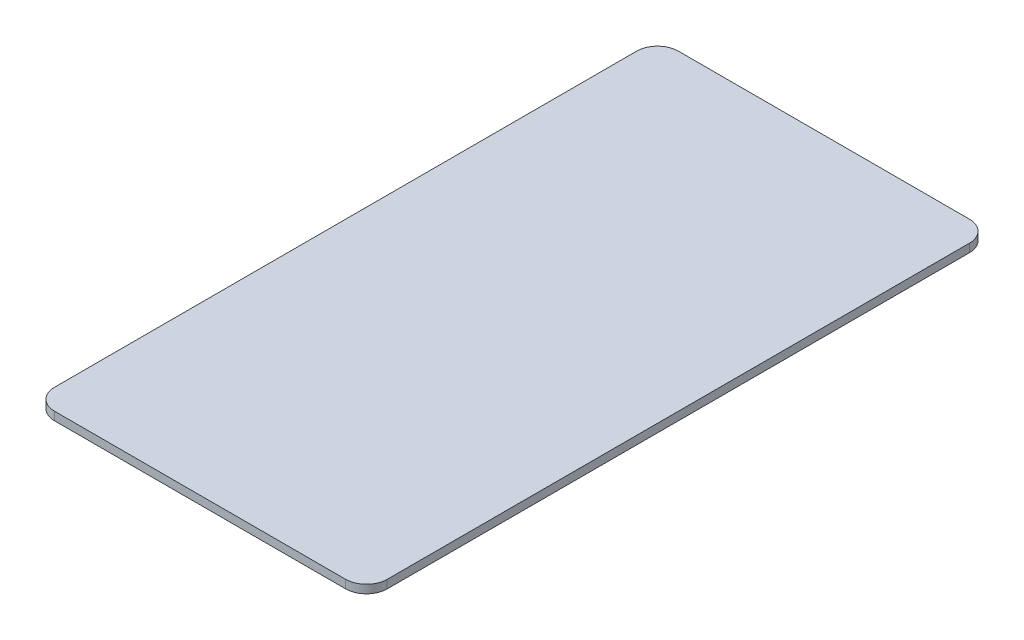
ISO-10303-21;
HEADER;
FILE_DESCRIPTION(('STEP AP214'),'2;1');
FILE_NAME('part.step','',(''),(''),'','','');
FILE_SCHEMA(('AUTOMOTIVE_DESIGN { 1 0 10303 214 1 1 1 1 }'));
ENDSEC;
DATA;
#1=APPLICATION_CONTEXT('core data for automotive mechanical design processes');
#2=APPLICATION_PROTOCOL_DEFINITION('international standard','automotive_design',2000,#1);
#3=PRODUCT_CONTEXT('',#1,'mechanical');
#4=PRODUCT('Part','Part','',(#3));
#5=PRODUCT_RELATED_PRODUCT_CATEGORY('part','',(#4));
#6=PRODUCT_DEFINITION_FORMATION('','',#4);
#7=PRODUCT_DEFINITION_CONTEXT('part definition',#1,'design');
#8=PRODUCT_DEFINITION('design','',#6,#7);
#9=PRODUCT_DEFINITION_SHAPE('','',#8);
#10=(LENGTH_UNIT() NAMED_UNIT(*) SI_UNIT(.MILLI.,.METRE.));
#11=(NAMED_UNIT(*) PLANE_ANGLE_UNIT() SI_UNIT($,.RADIAN.));
#12=(NAMED_UNIT(*) SI_UNIT($,.STERADIAN.) SOLID_ANGLE_UNIT());
#13=UNCERTAINTY_MEASURE_WITH_UNIT(LENGTH_MEASURE(1.E-05),#10,'distance_accuracy_value','');
#14=(GEOMETRIC_REPRESENTATION_CONTEXT(3) GLOBAL_UNCERTAINTY_ASSIGNED_CONTEXT((#13)) GLOBAL_UNIT_ASSIGNED_CONTEXT((#10,
#11,#12)) REPRESENTATION_CONTEXT('',''));
#15=CARTESIAN_POINT('',(0.,0.,0.));
#16=DIRECTION('',(0.,0.,1.));
#17=DIRECTION('',(1.,0.,0.));
#18=AXIS2_PLACEMENT_3D('',#15,#16,#17);
#19=CARTESIAN_POINT('',(0.,1.27,0.));
#20=DIRECTION('',(1.,0.,0.));
#21=DIRECTION('',(0.,0.,-1.));
#22=AXIS2_PLACEMENT_3D('',#19,#20,#21);
#23=PLANE('',#22);
#24=DIRECTION('',(0.,0.,1.));
#25=VECTOR('',#24,1.);
#26=CARTESIAN_POINT('',(0.,1.27,0.));
#27=LINE('',#26,#25);
#28=CARTESIAN_POINT('',(0.,1.27,-92.075));
#29=VERTEX_POINT('',#28);
#30=CARTESIAN_POINT('',(0.,1.27,-3.175));
#31=VERTEX_POINT('',#30);
#32=EDGE_CURVE('E121',#29,#31,#27,.T.);
#33=ORIENTED_EDGE('',*,*,#32,.F.);
#34=DIRECTION('',(0.,-1.,0.));
#35=VECTOR('',#34,1.);
#36=CARTESIAN_POINT('',(0.,1.27,-92.075));
#37=LINE('',#36,#35);
#38=CARTESIAN_POINT('',(0.,0.,-92.075));
#39=VERTEX_POINT('',#38);
#40=EDGE_CURVE('E106',#29,#39,#37,.T.);
#41=ORIENTED_EDGE('',*,*,#40,.T.);
#42=DIRECTION('',(0.,0.,1.));
#43=VECTOR('',#42,1.);
#44=CARTESIAN_POINT('',(0.,0.,0.));
#45=LINE('',#44,#43);
#46=CARTESIAN_POINT('',(0.,0.,-3.175));
#47=VERTEX_POINT('',#46);
#48=EDGE_CURVE('E118',#39,#47,#45,.T.);
#49=ORIENTED_EDGE('',*,*,#48,.T.);
#50=DIRECTION('',(0.,-1.,0.));
#51=VECTOR('',#50,1.);
#52=CARTESIAN_POINT('',(0.,1.27,-3.175));
#53=LINE('',#52,#51);
#54=EDGE_CURVE('E123',#47,#31,#53,.F.);
#55=ORIENTED_EDGE('',*,*,#54,.T.);
#56=EDGE_LOOP('',(#33,#41,#49,#55));
#57=FACE_BOUND('',#56,.T.);
#58=ADVANCED_FACE('F36',(#57),#23,.F.);
#59=CARTESIAN_POINT('',(0.,1.27,0.));
#60=DIRECTION('',(0.,0.,-1.));
#61=DIRECTION('',(-1.,0.,0.));
#62=AXIS2_PLACEMENT_3D('',#59,#60,#61);
#63=PLANE('',#62);
#64=DIRECTION('',(1.,0.,0.));
#65=VECTOR('',#64,1.);
#66=CARTESIAN_POINT('',(0.,0.,0.));
#67=LINE('',#66,#65);
#68=CARTESIAN_POINT('',(3.175,0.,0.));
#69=VERTEX_POINT('',#68);
#70=CARTESIAN_POINT('',(47.625,0.,0.));
#71=VERTEX_POINT('',#70);
#72=EDGE_CURVE('E127',#69,#71,#67,.T.);
#73=ORIENTED_EDGE('',*,*,#72,.T.);
#74=DIRECTION('',(0.,-1.,0.));
#75=VECTOR('',#74,1.);
#76=CARTESIAN_POINT('',(47.625,1.27,0.));
#77=LINE('',#76,#75);
#78=CARTESIAN_POINT('',(47.625,1.27,0.));
#79=VERTEX_POINT('',#78);
#80=EDGE_CURVE('E11',#71,#79,#77,.F.);
#81=ORIENTED_EDGE('',*,*,#80,.T.);
#82=DIRECTION('',(1.,0.,0.));
#83=VECTOR('',#82,1.);
#84=CARTESIAN_POINT('',(0.,1.27,0.));
#85=LINE('',#84,#83);
#86=CARTESIAN_POINT('',(3.175,1.27,0.));
#87=VERTEX_POINT('',#86);
#88=EDGE_CURVE('E163',#87,#79,#85,.T.);
#89=ORIENTED_EDGE('',*,*,#88,.F.);
#90=DIRECTION('',(0.,-1.,0.));
#91=VECTOR('',#90,1.);
#92=CARTESIAN_POINT('',(3.175,1.27,0.));
#93=LINE('',#92,#91);
#94=EDGE_CURVE('E44',#87,#69,#93,.T.);
#95=ORIENTED_EDGE('',*,*,#94,.T.);
#96=EDGE_LOOP('',(#73,#81,#89,#95));
#97=FACE_BOUND('',#96,.T.);
#98=ADVANCED_FACE('F161',(#97),#63,.F.);
#99=CARTESIAN_POINT('',(50.8,1.27,0.));
#100=DIRECTION('',(-1.,0.,0.));
#101=DIRECTION('',(0.,0.,1.));
#102=AXIS2_PLACEMENT_3D('',#99,#100,#101);
#103=PLANE('',#102);
#104=DIRECTION('',(0.,0.,-1.));
#105=VECTOR('',#104,1.);
#106=CARTESIAN_POINT('',(50.8,0.,0.));
#107=LINE('',#106,#105);
#108=CARTESIAN_POINT('',(50.8,0.,-3.175));
#109=VERTEX_POINT('',#108);
#110=CARTESIAN_POINT('',(50.8,0.,-92.075));
#111=VERTEX_POINT('',#110);
#112=EDGE_CURVE('E130',#109,#111,#107,.T.);
#113=ORIENTED_EDGE('',*,*,#112,.T.);
#114=DIRECTION('',(0.,-1.,0.));
#115=VECTOR('',#114,1.);
#116=CARTESIAN_POINT('',(50.8,1.27,-92.075));
#117=LINE('',#116,#115);
#118=CARTESIAN_POINT('',(50.8,1.27,-92.075));
#119=VERTEX_POINT('',#118);
#120=EDGE_CURVE('E51',#111,#119,#117,.F.);
#121=ORIENTED_EDGE('',*,*,#120,.T.);
#122=DIRECTION('',(0.,0.,-1.));
#123=VECTOR('',#122,1.);
#124=CARTESIAN_POINT('',(50.8,1.27,0.));
#125=LINE('',#124,#123);
#126=CARTESIAN_POINT('',(50.8,1.27,-3.175));
#127=VERTEX_POINT('',#126);
#128=EDGE_CURVE('E171',#127,#119,#125,.T.);
#129=ORIENTED_EDGE('',*,*,#128,.F.);
#130=DIRECTION('',(0.,-1.,0.));
#131=VECTOR('',#130,1.);
#132=CARTESIAN_POINT('',(50.8,1.27,-3.175));
#133=LINE('',#132,#131);
#134=EDGE_CURVE('E154',#127,#109,#133,.T.);
#135=ORIENTED_EDGE('',*,*,#134,.T.);
#136=EDGE_LOOP('',(#113,#121,#129,#135));
#137=FACE_BOUND('',#136,.T.);
#138=ADVANCED_FACE('F170',(#137),#103,.F.);
#139=CARTESIAN_POINT('',(0.,1.27,-95.25));
#140=DIRECTION('',(0.,0.,1.));
#141=DIRECTION('',(1.,0.,0.));
#142=AXIS2_PLACEMENT_3D('',#139,#140,#141);
#143=PLANE('',#142);
#144=DIRECTION('',(-1.,0.,0.));
#145=VECTOR('',#144,1.);
#146=CARTESIAN_POINT('',(0.,0.,-95.25));
#147=LINE('',#146,#145);
#148=CARTESIAN_POINT('',(47.625,0.,-95.25));
#149=VERTEX_POINT('',#148);
#150=CARTESIAN_POINT('',(3.175,0.,-95.25));
#151=VERTEX_POINT('',#150);
#152=EDGE_CURVE('E137',#149,#151,#147,.T.);
#153=ORIENTED_EDGE('',*,*,#152,.T.);
#154=DIRECTION('',(0.,-1.,0.));
#155=VECTOR('',#154,1.);
#156=CARTESIAN_POINT('',(3.175,1.27,-95.25));
#157=LINE('',#156,#155);
#158=CARTESIAN_POINT('',(3.175,1.27,-95.25));
#159=VERTEX_POINT('',#158);
#160=EDGE_CURVE('E107',#151,#159,#157,.F.);
#161=ORIENTED_EDGE('',*,*,#160,.T.);
#162=DIRECTION('',(-1.,0.,0.));
#163=VECTOR('',#162,1.);
#164=CARTESIAN_POINT('',(0.,1.27,-95.25));
#165=LINE('',#164,#163);
#166=CARTESIAN_POINT('',(47.625,1.27,-95.25));
#167=VERTEX_POINT('',#166);
#168=EDGE_CURVE('E133',#167,#159,#165,.T.);
#169=ORIENTED_EDGE('',*,*,#168,.F.);
#170=DIRECTION('',(0.,-1.,0.));
#171=VECTOR('',#170,1.);
#172=CARTESIAN_POINT('',(47.625,1.27,-95.25));
#173=LINE('',#172,#171);
#174=EDGE_CURVE('E112',#167,#149,#173,.T.);
#175=ORIENTED_EDGE('',*,*,#174,.T.);
#176=EDGE_LOOP('',(#153,#161,#169,#175));
#177=FACE_BOUND('',#176,.T.);
#178=ADVANCED_FACE('F199',(#177),#143,.F.);
#179=CARTESIAN_POINT('',(0.,1.27,0.));
#180=DIRECTION('',(0.,-1.,0.));
#181=DIRECTION('',(0.,0.,-1.));
#182=AXIS2_PLACEMENT_3D('',#179,#180,#181);
#183=PLANE('',#182);
#184=ORIENTED_EDGE('',*,*,#168,.T.);
#185=CARTESIAN_POINT('',(3.175,1.27,-92.075));
#186=DIRECTION('',(0.,-1.,0.));
#187=DIRECTION('',(0.,0.,-1.));
#188=AXIS2_PLACEMENT_3D('',#185,#186,#187);
#189=CIRCLE('',#188,3.175);
#190=EDGE_CURVE('E152',#159,#29,#189,.F.);
#191=ORIENTED_EDGE('',*,*,#190,.T.);
#192=ORIENTED_EDGE('',*,*,#32,.T.);
#193=CARTESIAN_POINT('',(3.175,1.27,-3.175));
#194=DIRECTION('',(0.,-1.,0.));
#195=DIRECTION('',(0.,0.,-1.));
#196=AXIS2_PLACEMENT_3D('',#193,#194,#195);
#197=CIRCLE('',#196,3.175);
#198=EDGE_CURVE('E147',#31,#87,#197,.F.);
#199=ORIENTED_EDGE('',*,*,#198,.T.);
#200=ORIENTED_EDGE('',*,*,#88,.T.);
#201=CARTESIAN_POINT('',(47.625,1.27,-3.175));
#202=DIRECTION('',(0.,-1.,0.));
#203=DIRECTION('',(0.,0.,-1.));
#204=AXIS2_PLACEMENT_3D('',#201,#202,#203);
#205=CIRCLE('',#204,3.175);
#206=EDGE_CURVE('E58',#79,#127,#205,.F.);
#207=ORIENTED_EDGE('',*,*,#206,.T.);
#208=ORIENTED_EDGE('',*,*,#128,.T.);
#209=CARTESIAN_POINT('',(47.625,1.27,-92.075));
#210=DIRECTION('',(0.,-1.,0.));
#211=DIRECTION('',(0.,0.,-1.));
#212=AXIS2_PLACEMENT_3D('',#209,#210,#211);
#213=CIRCLE('',#212,3.175);
#214=EDGE_CURVE('E150',#119,#167,#213,.F.);
#215=ORIENTED_EDGE('',*,*,#214,.T.);
#216=EDGE_LOOP('',(#184,#191,#192,#199,#200,#207,#208,#215));
#217=FACE_BOUND('',#216,.T.);
#218=ADVANCED_FACE('F176',(#217),#183,.F.);
#219=CARTESIAN_POINT('',(0.,0.,0.));
#220=DIRECTION('',(0.,-1.,0.));
#221=DIRECTION('',(0.,0.,-1.));
#222=AXIS2_PLACEMENT_3D('',#219,#220,#221);
#223=PLANE('',#222);
#224=ORIENTED_EDGE('',*,*,#48,.F.);
#225=CARTESIAN_POINT('',(3.175,0.,-92.075));
#226=DIRECTION('',(0.,-1.,0.));
#227=DIRECTION('',(0.,0.,-1.));
#228=AXIS2_PLACEMENT_3D('',#225,#226,#227);
#229=CIRCLE('',#228,3.175);
#230=EDGE_CURVE('E102',#39,#151,#229,.T.);
#231=ORIENTED_EDGE('',*,*,#230,.T.);
#232=ORIENTED_EDGE('',*,*,#152,.F.);
#233=CARTESIAN_POINT('',(47.625,0.,-92.075));
#234=DIRECTION('',(0.,-1.,0.));
#235=DIRECTION('',(0.,0.,-1.));
#236=AXIS2_PLACEMENT_3D('',#233,#234,#235);
#237=CIRCLE('',#236,3.175);
#238=EDGE_CURVE('E113',#149,#111,#237,.T.);
#239=ORIENTED_EDGE('',*,*,#238,.T.);
#240=ORIENTED_EDGE('',*,*,#112,.F.);
#241=CARTESIAN_POINT('',(47.625,0.,-3.175));
#242=DIRECTION('',(0.,-1.,0.));
#243=DIRECTION('',(0.,0.,-1.));
#244=AXIS2_PLACEMENT_3D('',#241,#242,#243);
#245=CIRCLE('',#244,3.175);
#246=EDGE_CURVE('E141',#109,#71,#245,.T.);
#247=ORIENTED_EDGE('',*,*,#246,.T.);
#248=ORIENTED_EDGE('',*,*,#72,.F.);
#249=CARTESIAN_POINT('',(3.175,0.,-3.175));
#250=DIRECTION('',(0.,-1.,0.));
#251=DIRECTION('',(0.,0.,-1.));
#252=AXIS2_PLACEMENT_3D('',#249,#250,#251);
#253=CIRCLE('',#252,3.175);
#254=EDGE_CURVE('E122',#69,#47,#253,.T.);
#255=ORIENTED_EDGE('',*,*,#254,.T.);
#256=EDGE_LOOP('',(#224,#231,#232,#239,#240,#247,#248,#255));
#257=FACE_BOUND('',#256,.T.);
#258=ADVANCED_FACE('F125',(#257),#223,.T.);
#259=CARTESIAN_POINT('',(3.175,1.27,-92.075));
#260=DIRECTION('',(0.,-1.,0.));
#261=DIRECTION('',(0.,0.,-1.));
#262=AXIS2_PLACEMENT_3D('',#259,#260,#261);
#263=CYLINDRICAL_SURFACE('',#262,3.175);
#264=ORIENTED_EDGE('',*,*,#190,.F.);
#265=ORIENTED_EDGE('',*,*,#160,.F.);
#266=ORIENTED_EDGE('',*,*,#230,.F.);
#267=ORIENTED_EDGE('',*,*,#40,.F.);
#268=EDGE_LOOP('',(#264,#265,#266,#267));
#269=FACE_BOUND('',#268,.T.);
#270=ADVANCED_FACE('F105',(#269),#263,.T.);
#271=CARTESIAN_POINT('',(47.625,1.27,-92.075));
#272=DIRECTION('',(0.,-1.,0.));
#273=DIRECTION('',(0.,0.,-1.));
#274=AXIS2_PLACEMENT_3D('',#271,#272,#273);
#275=CYLINDRICAL_SURFACE('',#274,3.175);
#276=ORIENTED_EDGE('',*,*,#214,.F.);
#277=ORIENTED_EDGE('',*,*,#120,.F.);
#278=ORIENTED_EDGE('',*,*,#238,.F.);
#279=ORIENTED_EDGE('',*,*,#174,.F.);
#280=EDGE_LOOP('',(#276,#277,#278,#279));
#281=FACE_BOUND('',#280,.T.);
#282=ADVANCED_FACE('F181',(#281),#275,.T.);
#283=CARTESIAN_POINT('',(47.625,1.27,-3.175));
#284=DIRECTION('',(0.,-1.,0.));
#285=DIRECTION('',(0.,0.,-1.));
#286=AXIS2_PLACEMENT_3D('',#283,#284,#285);
#287=CYLINDRICAL_SURFACE('',#286,3.175);
#288=ORIENTED_EDGE('',*,*,#206,.F.);
#289=ORIENTED_EDGE('',*,*,#80,.F.);
#290=ORIENTED_EDGE('',*,*,#246,.F.);
#291=ORIENTED_EDGE('',*,*,#134,.F.);
#292=EDGE_LOOP('',(#288,#289,#290,#291));
#293=FACE_BOUND('',#292,.T.);
#294=ADVANCED_FACE('F169',(#293),#287,.T.);
#295=CARTESIAN_POINT('',(3.175,1.27,-3.175));
#296=DIRECTION('',(0.,-1.,0.));
#297=DIRECTION('',(0.,0.,-1.));
#298=AXIS2_PLACEMENT_3D('',#295,#296,#297);
#299=CYLINDRICAL_SURFACE('',#298,3.175);
#300=ORIENTED_EDGE('',*,*,#198,.F.);
#301=ORIENTED_EDGE('',*,*,#54,.F.);
#302=ORIENTED_EDGE('',*,*,#254,.F.);
#303=ORIENTED_EDGE('',*,*,#94,.F.);
#304=EDGE_LOOP('',(#300,#301,#302,#303));
#305=FACE_BOUND('',#304,.T.);
#306=ADVANCED_FACE('F38',(#305),#299,.T.);
#307=CLOSED_SHELL('',(#58,#98,#138,#178,#218,#258,#270,#282,#294,#306));
#308=MANIFOLD_SOLID_BREP('B2',#307);
#309=ADVANCED_BREP_SHAPE_REPRESENTATION('',(#18,#308),#14);
#310=SHAPE_DEFINITION_REPRESENTATION(#9,#309);
ENDSEC;
END-ISO-10303-21;
